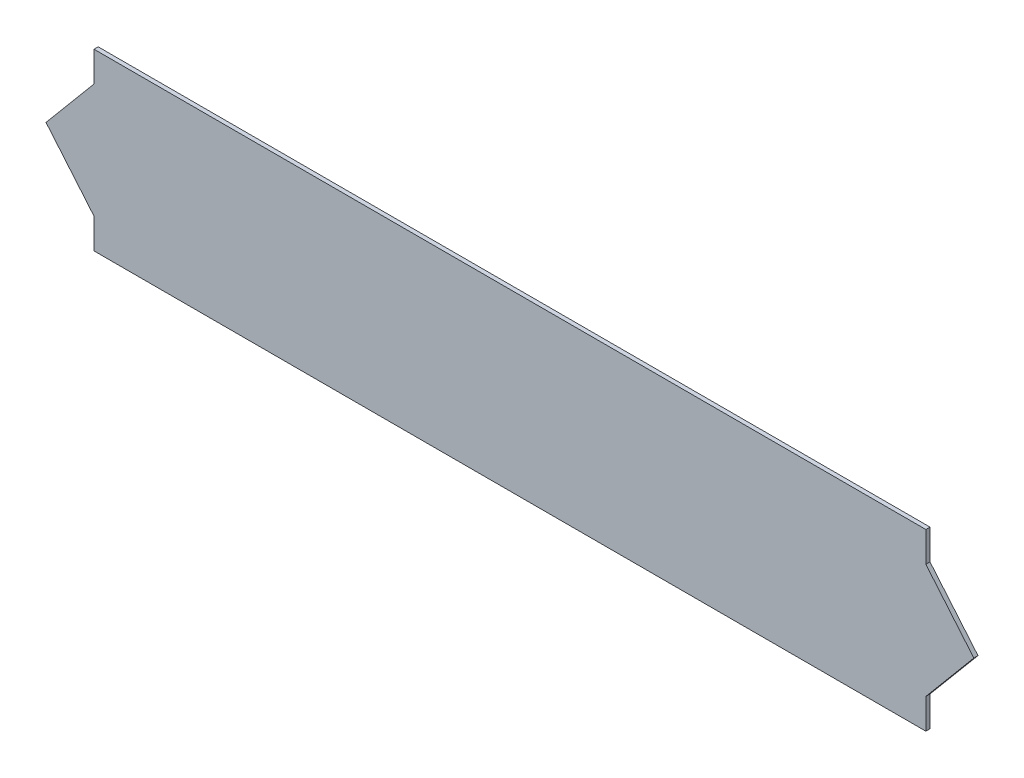
ISO-10303-21;
HEADER;
FILE_DESCRIPTION(('STEP AP214'),'2;1');
FILE_NAME('part.step','',(''),(''),'','','');
FILE_SCHEMA(('AUTOMOTIVE_DESIGN { 1 0 10303 214 1 1 1 1 }'));
ENDSEC;
DATA;
#1=APPLICATION_CONTEXT('core data for automotive mechanical design processes');
#2=APPLICATION_PROTOCOL_DEFINITION('international standard','automotive_design',2000,#1);
#3=PRODUCT_CONTEXT('',#1,'mechanical');
#4=PRODUCT('Part','Part','',(#3));
#5=PRODUCT_RELATED_PRODUCT_CATEGORY('part','',(#4));
#6=PRODUCT_DEFINITION_FORMATION('','',#4);
#7=PRODUCT_DEFINITION_CONTEXT('part definition',#1,'design');
#8=PRODUCT_DEFINITION('design','',#6,#7);
#9=PRODUCT_DEFINITION_SHAPE('','',#8);
#10=(LENGTH_UNIT() NAMED_UNIT(*) SI_UNIT(.MILLI.,.METRE.));
#11=(NAMED_UNIT(*) PLANE_ANGLE_UNIT() SI_UNIT($,.RADIAN.));
#12=(NAMED_UNIT(*) SI_UNIT($,.STERADIAN.) SOLID_ANGLE_UNIT());
#13=UNCERTAINTY_MEASURE_WITH_UNIT(LENGTH_MEASURE(1.E-05),#10,'distance_accuracy_value','');
#14=(GEOMETRIC_REPRESENTATION_CONTEXT(3) GLOBAL_UNCERTAINTY_ASSIGNED_CONTEXT((#13)) GLOBAL_UNIT_ASSIGNED_CONTEXT((#10,
#11,#12)) REPRESENTATION_CONTEXT('',''));
#15=CARTESIAN_POINT('',(0.,0.,0.));
#16=DIRECTION('',(0.,0.,1.));
#17=DIRECTION('',(1.,0.,0.));
#18=AXIS2_PLACEMENT_3D('',#15,#16,#17);
#19=CARTESIAN_POINT('',(-200.,-14.5,2.));
#20=DIRECTION('',(0.766044443118977,-0.642787609686541,0.));
#21=DIRECTION('',(0.642787609686541,0.766044443118977,0.));
#22=AXIS2_PLACEMENT_3D('',#19,#20,#21);
#23=PLANE('',#22);
#24=DIRECTION('',(-0.642787609686541,-0.766044443118977,0.));
#25=VECTOR('',#24,1.);
#26=CARTESIAN_POINT('',(-200.,-14.5,0.));
#27=LINE('',#26,#25);
#28=CARTESIAN_POINT('',(-200.,-14.5,0.));
#29=VERTEX_POINT('',#28);
#30=CARTESIAN_POINT('',(-223.075239857375,-42.0000000000001,0.));
#31=VERTEX_POINT('',#30);
#32=EDGE_CURVE('E142',#29,#31,#27,.T.);
#33=ORIENTED_EDGE('',*,*,#32,.T.);
#34=DIRECTION('',(0.,0.,-1.));
#35=VECTOR('',#34,1.);
#36=CARTESIAN_POINT('',(-223.075239857375,-42.0000000000001,2.));
#37=LINE('',#36,#35);
#38=CARTESIAN_POINT('',(-223.075239857375,-42.0000000000001,2.));
#39=VERTEX_POINT('',#38);
#40=EDGE_CURVE('E11',#39,#31,#37,.T.);
#41=ORIENTED_EDGE('',*,*,#40,.F.);
#42=DIRECTION('',(-0.642787609686541,-0.766044443118977,0.));
#43=VECTOR('',#42,1.);
#44=CARTESIAN_POINT('',(-200.,-14.5,2.));
#45=LINE('',#44,#43);
#46=CARTESIAN_POINT('',(-200.,-14.5,2.));
#47=VERTEX_POINT('',#46);
#48=EDGE_CURVE('E160',#47,#39,#45,.T.);
#49=ORIENTED_EDGE('',*,*,#48,.F.);
#50=DIRECTION('',(0.,0.,-1.));
#51=VECTOR('',#50,1.);
#52=CARTESIAN_POINT('',(-200.,-14.5,2.));
#53=LINE('',#52,#51);
#54=EDGE_CURVE('E138',#47,#29,#53,.T.);
#55=ORIENTED_EDGE('',*,*,#54,.T.);
#56=EDGE_LOOP('',(#33,#41,#49,#55));
#57=FACE_BOUND('',#56,.T.);
#58=ADVANCED_FACE('F34',(#57),#23,.F.);
#59=CARTESIAN_POINT('',(-223.075239857375,-42.0000000000001,2.));
#60=DIRECTION('',(0.766044443118976,0.642787609686541,0.));
#61=DIRECTION('',(-0.642787609686541,0.766044443118976,0.));
#62=AXIS2_PLACEMENT_3D('',#59,#60,#61);
#63=PLANE('',#62);
#64=DIRECTION('',(0.642787609686541,-0.766044443118976,0.));
#65=VECTOR('',#64,1.);
#66=CARTESIAN_POINT('',(-223.075239857375,-42.0000000000001,0.));
#67=LINE('',#66,#65);
#68=CARTESIAN_POINT('',(-200.,-69.5,0.));
#69=VERTEX_POINT('',#68);
#70=EDGE_CURVE('E145',#31,#69,#67,.T.);
#71=ORIENTED_EDGE('',*,*,#70,.T.);
#72=DIRECTION('',(0.,0.,-1.));
#73=VECTOR('',#72,1.);
#74=CARTESIAN_POINT('',(-200.,-69.5,2.));
#75=LINE('',#74,#73);
#76=CARTESIAN_POINT('',(-200.,-69.5,2.));
#77=VERTEX_POINT('',#76);
#78=EDGE_CURVE('E42',#77,#69,#75,.T.);
#79=ORIENTED_EDGE('',*,*,#78,.F.);
#80=DIRECTION('',(0.642787609686541,-0.766044443118976,0.));
#81=VECTOR('',#80,1.);
#82=CARTESIAN_POINT('',(-223.075239857375,-42.0000000000001,2.));
#83=LINE('',#82,#81);
#84=EDGE_CURVE('E99',#39,#77,#83,.T.);
#85=ORIENTED_EDGE('',*,*,#84,.F.);
#86=ORIENTED_EDGE('',*,*,#40,.T.);
#87=EDGE_LOOP('',(#71,#79,#85,#86));
#88=FACE_BOUND('',#87,.T.);
#89=ADVANCED_FACE('F209',(#88),#63,.F.);
#90=CARTESIAN_POINT('',(-200.,-69.5,2.));
#91=DIRECTION('',(1.,0.,0.));
#92=DIRECTION('',(0.,0.,-1.));
#93=AXIS2_PLACEMENT_3D('',#90,#91,#92);
#94=PLANE('',#93);
#95=DIRECTION('',(0.,-1.,0.));
#96=VECTOR('',#95,1.);
#97=CARTESIAN_POINT('',(-200.,-69.5,0.));
#98=LINE('',#97,#96);
#99=CARTESIAN_POINT('',(-200.,-84.,0.));
#100=VERTEX_POINT('',#99);
#101=EDGE_CURVE('E147',#69,#100,#98,.T.);
#102=ORIENTED_EDGE('',*,*,#101,.T.);
#103=DIRECTION('',(0.,0.,-1.));
#104=VECTOR('',#103,1.);
#105=CARTESIAN_POINT('',(-200.,-84.,2.));
#106=LINE('',#105,#104);
#107=CARTESIAN_POINT('',(-200.,-84.,2.));
#108=VERTEX_POINT('',#107);
#109=EDGE_CURVE('E173',#108,#100,#106,.T.);
#110=ORIENTED_EDGE('',*,*,#109,.F.);
#111=DIRECTION('',(0.,-1.,0.));
#112=VECTOR('',#111,1.);
#113=CARTESIAN_POINT('',(-200.,-69.5,2.));
#114=LINE('',#113,#112);
#115=EDGE_CURVE('E181',#77,#108,#114,.T.);
#116=ORIENTED_EDGE('',*,*,#115,.F.);
#117=ORIENTED_EDGE('',*,*,#78,.T.);
#118=EDGE_LOOP('',(#102,#110,#116,#117));
#119=FACE_BOUND('',#118,.T.);
#120=ADVANCED_FACE('F179',(#119),#94,.F.);
#121=CARTESIAN_POINT('',(-200.,-84.,2.));
#122=DIRECTION('',(0.,1.,0.));
#123=DIRECTION('',(-1.,0.,0.));
#124=AXIS2_PLACEMENT_3D('',#121,#122,#123);
#125=PLANE('',#124);
#126=DIRECTION('',(1.,0.,0.));
#127=VECTOR('',#126,1.);
#128=CARTESIAN_POINT('',(-200.,-84.,0.));
#129=LINE('',#128,#127);
#130=CARTESIAN_POINT('',(200.,-84.,0.));
#131=VERTEX_POINT('',#130);
#132=EDGE_CURVE('E149',#100,#131,#129,.T.);
#133=ORIENTED_EDGE('',*,*,#132,.T.);
#134=DIRECTION('',(0.,0.,-1.));
#135=VECTOR('',#134,1.);
#136=CARTESIAN_POINT('',(200.,-84.,2.));
#137=LINE('',#136,#135);
#138=CARTESIAN_POINT('',(200.,-84.,2.));
#139=VERTEX_POINT('',#138);
#140=EDGE_CURVE('E170',#139,#131,#137,.T.);
#141=ORIENTED_EDGE('',*,*,#140,.F.);
#142=DIRECTION('',(1.,0.,0.));
#143=VECTOR('',#142,1.);
#144=CARTESIAN_POINT('',(-200.,-84.,2.));
#145=LINE('',#144,#143);
#146=EDGE_CURVE('E199',#108,#139,#145,.T.);
#147=ORIENTED_EDGE('',*,*,#146,.F.);
#148=ORIENTED_EDGE('',*,*,#109,.T.);
#149=EDGE_LOOP('',(#133,#141,#147,#148));
#150=FACE_BOUND('',#149,.T.);
#151=ADVANCED_FACE('F190',(#150),#125,.F.);
#152=CARTESIAN_POINT('',(200.,-69.5,2.));
#153=DIRECTION('',(-1.,0.,0.));
#154=DIRECTION('',(0.,0.,1.));
#155=AXIS2_PLACEMENT_3D('',#152,#153,#154);
#156=PLANE('',#155);
#157=DIRECTION('',(0.,1.,0.));
#158=VECTOR('',#157,1.);
#159=CARTESIAN_POINT('',(200.,-69.5,0.));
#160=LINE('',#159,#158);
#161=CARTESIAN_POINT('',(200.,-69.5,0.));
#162=VERTEX_POINT('',#161);
#163=EDGE_CURVE('E151',#131,#162,#160,.T.);
#164=ORIENTED_EDGE('',*,*,#163,.T.);
#165=DIRECTION('',(0.,0.,-1.));
#166=VECTOR('',#165,1.);
#167=CARTESIAN_POINT('',(200.,-69.5,2.));
#168=LINE('',#167,#166);
#169=CARTESIAN_POINT('',(200.,-69.5,2.));
#170=VERTEX_POINT('',#169);
#171=EDGE_CURVE('E167',#170,#162,#168,.T.);
#172=ORIENTED_EDGE('',*,*,#171,.F.);
#173=DIRECTION('',(0.,1.,0.));
#174=VECTOR('',#173,1.);
#175=CARTESIAN_POINT('',(200.,-69.5,2.));
#176=LINE('',#175,#174);
#177=EDGE_CURVE('E196',#139,#170,#176,.T.);
#178=ORIENTED_EDGE('',*,*,#177,.F.);
#179=ORIENTED_EDGE('',*,*,#140,.T.);
#180=EDGE_LOOP('',(#164,#172,#178,#179));
#181=FACE_BOUND('',#180,.T.);
#182=ADVANCED_FACE('F194',(#181),#156,.F.);
#183=CARTESIAN_POINT('',(223.075239857375,-42.,2.));
#184=DIRECTION('',(-0.766044443118976,0.642787609686541,0.));
#185=DIRECTION('',(-0.642787609686541,-0.766044443118976,0.));
#186=AXIS2_PLACEMENT_3D('',#183,#184,#185);
#187=PLANE('',#186);
#188=DIRECTION('',(0.642787609686541,0.766044443118976,0.));
#189=VECTOR('',#188,1.);
#190=CARTESIAN_POINT('',(223.075239857375,-42.,0.));
#191=LINE('',#190,#189);
#192=CARTESIAN_POINT('',(223.075239857375,-42.,0.));
#193=VERTEX_POINT('',#192);
#194=EDGE_CURVE('E153',#162,#193,#191,.T.);
#195=ORIENTED_EDGE('',*,*,#194,.T.);
#196=DIRECTION('',(0.,0.,-1.));
#197=VECTOR('',#196,1.);
#198=CARTESIAN_POINT('',(223.075239857375,-42.,2.));
#199=LINE('',#198,#197);
#200=CARTESIAN_POINT('',(223.075239857375,-42.,2.));
#201=VERTEX_POINT('',#200);
#202=EDGE_CURVE('E164',#201,#193,#199,.T.);
#203=ORIENTED_EDGE('',*,*,#202,.F.);
#204=DIRECTION('',(0.642787609686541,0.766044443118976,0.));
#205=VECTOR('',#204,1.);
#206=CARTESIAN_POINT('',(223.075239857375,-42.,2.));
#207=LINE('',#206,#205);
#208=EDGE_CURVE('E198',#170,#201,#207,.T.);
#209=ORIENTED_EDGE('',*,*,#208,.F.);
#210=ORIENTED_EDGE('',*,*,#171,.T.);
#211=EDGE_LOOP('',(#195,#203,#209,#210));
#212=FACE_BOUND('',#211,.T.);
#213=ADVANCED_FACE('F221',(#212),#187,.F.);
#214=CARTESIAN_POINT('',(200.,-14.5,2.));
#215=DIRECTION('',(-0.766044443118977,-0.642787609686541,0.));
#216=DIRECTION('',(0.642787609686541,-0.766044443118977,0.));
#217=AXIS2_PLACEMENT_3D('',#214,#215,#216);
#218=PLANE('',#217);
#219=DIRECTION('',(-0.642787609686541,0.766044443118977,0.));
#220=VECTOR('',#219,1.);
#221=CARTESIAN_POINT('',(200.,-14.5,0.));
#222=LINE('',#221,#220);
#223=CARTESIAN_POINT('',(200.,-14.5,0.));
#224=VERTEX_POINT('',#223);
#225=EDGE_CURVE('E155',#193,#224,#222,.T.);
#226=ORIENTED_EDGE('',*,*,#225,.T.);
#227=DIRECTION('',(0.,0.,-1.));
#228=VECTOR('',#227,1.);
#229=CARTESIAN_POINT('',(200.,-14.5,2.));
#230=LINE('',#229,#228);
#231=CARTESIAN_POINT('',(200.,-14.5,2.));
#232=VERTEX_POINT('',#231);
#233=EDGE_CURVE('E133',#232,#224,#230,.T.);
#234=ORIENTED_EDGE('',*,*,#233,.F.);
#235=DIRECTION('',(-0.642787609686541,0.766044443118977,0.));
#236=VECTOR('',#235,1.);
#237=CARTESIAN_POINT('',(200.,-14.5,2.));
#238=LINE('',#237,#236);
#239=EDGE_CURVE('E124',#201,#232,#238,.T.);
#240=ORIENTED_EDGE('',*,*,#239,.F.);
#241=ORIENTED_EDGE('',*,*,#202,.T.);
#242=EDGE_LOOP('',(#226,#234,#240,#241));
#243=FACE_BOUND('',#242,.T.);
#244=ADVANCED_FACE('F224',(#243),#218,.F.);
#245=CARTESIAN_POINT('',(200.,0.,2.));
#246=DIRECTION('',(-1.,0.,0.));
#247=DIRECTION('',(0.,0.,1.));
#248=AXIS2_PLACEMENT_3D('',#245,#246,#247);
#249=PLANE('',#248);
#250=DIRECTION('',(0.,1.,0.));
#251=VECTOR('',#250,1.);
#252=CARTESIAN_POINT('',(200.,0.,0.));
#253=LINE('',#252,#251);
#254=CARTESIAN_POINT('',(200.,0.,0.));
#255=VERTEX_POINT('',#254);
#256=EDGE_CURVE('E132',#224,#255,#253,.T.);
#257=ORIENTED_EDGE('',*,*,#256,.T.);
#258=DIRECTION('',(0.,0.,-1.));
#259=VECTOR('',#258,1.);
#260=CARTESIAN_POINT('',(200.,0.,2.));
#261=LINE('',#260,#259);
#262=CARTESIAN_POINT('',(200.,0.,2.));
#263=VERTEX_POINT('',#262);
#264=EDGE_CURVE('E129',#263,#255,#261,.T.);
#265=ORIENTED_EDGE('',*,*,#264,.F.);
#266=DIRECTION('',(0.,1.,0.));
#267=VECTOR('',#266,1.);
#268=CARTESIAN_POINT('',(200.,0.,2.));
#269=LINE('',#268,#267);
#270=EDGE_CURVE('E118',#232,#263,#269,.T.);
#271=ORIENTED_EDGE('',*,*,#270,.F.);
#272=ORIENTED_EDGE('',*,*,#233,.T.);
#273=EDGE_LOOP('',(#257,#265,#271,#272));
#274=FACE_BOUND('',#273,.T.);
#275=ADVANCED_FACE('F130',(#274),#249,.F.);
#276=CARTESIAN_POINT('',(200.,0.,2.));
#277=DIRECTION('',(0.,-1.,0.));
#278=DIRECTION('',(1.,0.,0.));
#279=AXIS2_PLACEMENT_3D('',#276,#277,#278);
#280=PLANE('',#279);
#281=DIRECTION('',(-1.,0.,0.));
#282=VECTOR('',#281,1.);
#283=CARTESIAN_POINT('',(200.,0.,0.));
#284=LINE('',#283,#282);
#285=CARTESIAN_POINT('',(-200.,0.,0.));
#286=VERTEX_POINT('',#285);
#287=EDGE_CURVE('E85',#255,#286,#284,.T.);
#288=ORIENTED_EDGE('',*,*,#287,.T.);
#289=DIRECTION('',(0.,0.,-1.));
#290=VECTOR('',#289,1.);
#291=CARTESIAN_POINT('',(-200.,0.,2.));
#292=LINE('',#291,#290);
#293=CARTESIAN_POINT('',(-200.,0.,2.));
#294=VERTEX_POINT('',#293);
#295=EDGE_CURVE('E134',#294,#286,#292,.T.);
#296=ORIENTED_EDGE('',*,*,#295,.F.);
#297=DIRECTION('',(-1.,0.,0.));
#298=VECTOR('',#297,1.);
#299=CARTESIAN_POINT('',(200.,0.,2.));
#300=LINE('',#299,#298);
#301=EDGE_CURVE('E122',#263,#294,#300,.T.);
#302=ORIENTED_EDGE('',*,*,#301,.F.);
#303=ORIENTED_EDGE('',*,*,#264,.T.);
#304=EDGE_LOOP('',(#288,#296,#302,#303));
#305=FACE_BOUND('',#304,.T.);
#306=ADVANCED_FACE('F136',(#305),#280,.F.);
#307=CARTESIAN_POINT('',(-200.,0.,2.));
#308=DIRECTION('',(1.,0.,0.));
#309=DIRECTION('',(0.,0.,-1.));
#310=AXIS2_PLACEMENT_3D('',#307,#308,#309);
#311=PLANE('',#310);
#312=DIRECTION('',(0.,-1.,0.));
#313=VECTOR('',#312,1.);
#314=CARTESIAN_POINT('',(-200.,0.,0.));
#315=LINE('',#314,#313);
#316=EDGE_CURVE('E91',#286,#29,#315,.T.);
#317=ORIENTED_EDGE('',*,*,#316,.T.);
#318=ORIENTED_EDGE('',*,*,#54,.F.);
#319=DIRECTION('',(0.,-1.,0.));
#320=VECTOR('',#319,1.);
#321=CARTESIAN_POINT('',(-200.,0.,2.));
#322=LINE('',#321,#320);
#323=EDGE_CURVE('E50',#294,#47,#322,.T.);
#324=ORIENTED_EDGE('',*,*,#323,.F.);
#325=ORIENTED_EDGE('',*,*,#295,.T.);
#326=EDGE_LOOP('',(#317,#318,#324,#325));
#327=FACE_BOUND('',#326,.T.);
#328=ADVANCED_FACE('F233',(#327),#311,.F.);
#329=CARTESIAN_POINT('',(0.,0.,2.));
#330=DIRECTION('',(0.,0.,1.));
#331=DIRECTION('',(1.,0.,0.));
#332=AXIS2_PLACEMENT_3D('',#329,#330,#331);
#333=PLANE('',#332);
#334=ORIENTED_EDGE('',*,*,#48,.T.);
#335=ORIENTED_EDGE('',*,*,#84,.T.);
#336=ORIENTED_EDGE('',*,*,#115,.T.);
#337=ORIENTED_EDGE('',*,*,#146,.T.);
#338=ORIENTED_EDGE('',*,*,#177,.T.);
#339=ORIENTED_EDGE('',*,*,#208,.T.);
#340=ORIENTED_EDGE('',*,*,#239,.T.);
#341=ORIENTED_EDGE('',*,*,#270,.T.);
#342=ORIENTED_EDGE('',*,*,#301,.T.);
#343=ORIENTED_EDGE('',*,*,#323,.T.);
#344=EDGE_LOOP('',(#334,#335,#336,#337,#338,#339,#340,#341,#342,#343));
#345=FACE_BOUND('',#344,.T.);
#346=ADVANCED_FACE('F120',(#345),#333,.T.);
#347=CARTESIAN_POINT('',(0.,0.,0.));
#348=DIRECTION('',(0.,0.,1.));
#349=DIRECTION('',(1.,0.,0.));
#350=AXIS2_PLACEMENT_3D('',#347,#348,#349);
#351=PLANE('',#350);
#352=ORIENTED_EDGE('',*,*,#32,.F.);
#353=ORIENTED_EDGE('',*,*,#316,.F.);
#354=ORIENTED_EDGE('',*,*,#287,.F.);
#355=ORIENTED_EDGE('',*,*,#256,.F.);
#356=ORIENTED_EDGE('',*,*,#225,.F.);
#357=ORIENTED_EDGE('',*,*,#194,.F.);
#358=ORIENTED_EDGE('',*,*,#163,.F.);
#359=ORIENTED_EDGE('',*,*,#132,.F.);
#360=ORIENTED_EDGE('',*,*,#101,.F.);
#361=ORIENTED_EDGE('',*,*,#70,.F.);
#362=EDGE_LOOP('',(#352,#353,#354,#355,#356,#357,#358,#359,#360,#361));
#363=FACE_BOUND('',#362,.T.);
#364=ADVANCED_FACE('F185',(#363),#351,.F.);
#365=CLOSED_SHELL('',(#58,#89,#120,#151,#182,#213,#244,#275,#306,#328,#346,#364));
#366=MANIFOLD_SOLID_BREP('B2',#365);
#367=ADVANCED_BREP_SHAPE_REPRESENTATION('',(#18,#366),#14);
#368=SHAPE_DEFINITION_REPRESENTATION(#9,#367);
ENDSEC;
END-ISO-10303-21;
